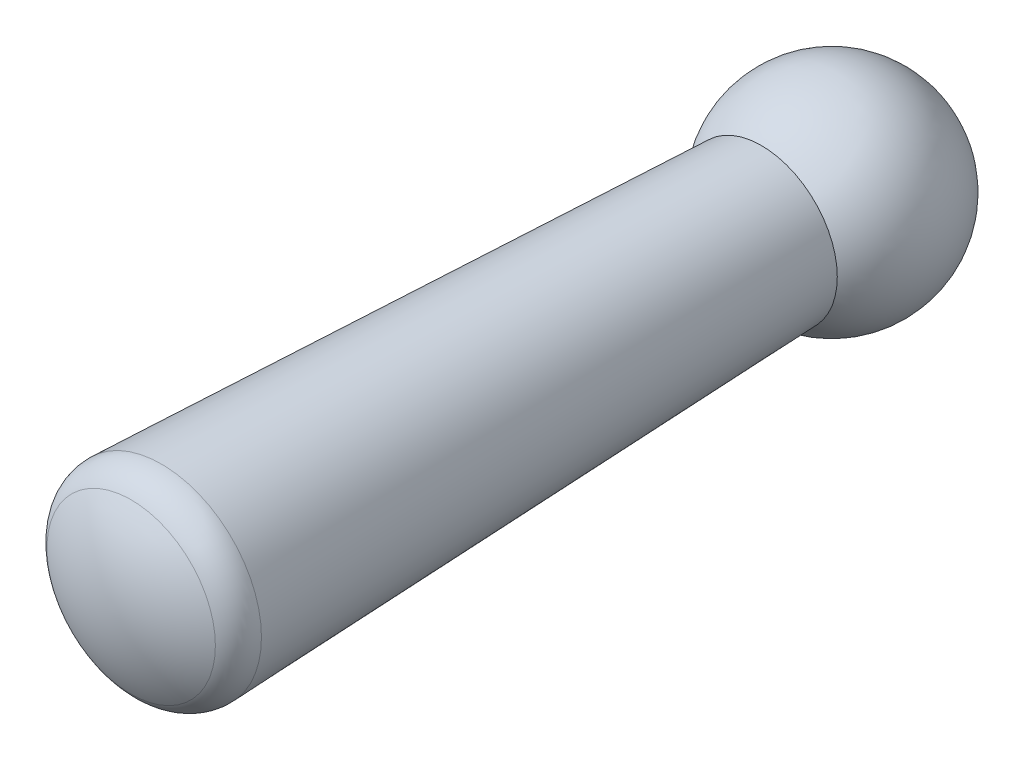
ISO-10303-21;
HEADER;
FILE_DESCRIPTION(('STEP AP214'),'2;1');
FILE_NAME('part.step','',(''),(''),'','','');
FILE_SCHEMA(('AUTOMOTIVE_DESIGN { 1 0 10303 214 1 1 1 1 }'));
ENDSEC;
DATA;
#1=APPLICATION_CONTEXT('core data for automotive mechanical design processes');
#2=APPLICATION_PROTOCOL_DEFINITION('international standard','automotive_design',2000,#1);
#3=PRODUCT_CONTEXT('',#1,'mechanical');
#4=PRODUCT('Part','Part','',(#3));
#5=PRODUCT_RELATED_PRODUCT_CATEGORY('part','',(#4));
#6=PRODUCT_DEFINITION_FORMATION('','',#4);
#7=PRODUCT_DEFINITION_CONTEXT('part definition',#1,'design');
#8=PRODUCT_DEFINITION('design','',#6,#7);
#9=PRODUCT_DEFINITION_SHAPE('','',#8);
#10=(LENGTH_UNIT() NAMED_UNIT(*) SI_UNIT(.MILLI.,.METRE.));
#11=(NAMED_UNIT(*) PLANE_ANGLE_UNIT() SI_UNIT($,.RADIAN.));
#12=(NAMED_UNIT(*) SI_UNIT($,.STERADIAN.) SOLID_ANGLE_UNIT());
#13=UNCERTAINTY_MEASURE_WITH_UNIT(LENGTH_MEASURE(1.E-05),#10,'distance_accuracy_value','');
#14=(GEOMETRIC_REPRESENTATION_CONTEXT(3) GLOBAL_UNCERTAINTY_ASSIGNED_CONTEXT((#13)) GLOBAL_UNIT_ASSIGNED_CONTEXT((#10,
#11,#12)) REPRESENTATION_CONTEXT('',''));
#15=CARTESIAN_POINT('',(0.,0.,0.));
#16=DIRECTION('',(0.,0.,1.));
#17=DIRECTION('',(1.,0.,0.));
#18=AXIS2_PLACEMENT_3D('',#15,#16,#17);
#19=CARTESIAN_POINT('',(0.,0.,16.539607805437));
#20=DIRECTION('',(0.,0.,1.));
#21=DIRECTION('',(1.,0.,0.));
#22=AXIS2_PLACEMENT_3D('',#19,#20,#21);
#23=SPHERICAL_SURFACE('',#22,4.5);
#24=CARTESIAN_POINT('',(0.,0.,16.539607805437));
#25=DIRECTION('',(0.,-1.,0.));
#26=DIRECTION('',(1.,0.,0.));
#27=AXIS2_PLACEMENT_3D('',#24,#25,#26);
#28=CIRCLE('',#27,4.5);
#29=CARTESIAN_POINT('',(2.442857142857,0.,20.318820551445));
#30=VERTEX_POINT('',#29);
#31=CARTESIAN_POINT('',(0.,0.,21.039607805437));
#32=VERTEX_POINT('',#31);
#33=EDGE_CURVE('E11',#30,#32,#28,.T.);
#34=ORIENTED_EDGE('',*,*,#33,.T.);
#35=ORIENTED_EDGE('',*,*,#33,.F.);
#36=CARTESIAN_POINT('',(0.,0.,20.318820551445));
#37=DIRECTION('',(0.,0.,-1.));
#38=DIRECTION('',(1.,0.,0.));
#39=AXIS2_PLACEMENT_3D('',#36,#37,#38);
#40=CIRCLE('',#39,2.442857142857);
#41=EDGE_CURVE('E26',#30,#30,#40,.T.);
#42=ORIENTED_EDGE('',*,*,#41,.F.);
#43=EDGE_LOOP('',(#34,#35,#42));
#44=FACE_BOUND('',#43,.T.);
#45=ADVANCED_FACE('F17',(#44),#23,.T.);
#46=CARTESIAN_POINT('',(0.,0.,19.478995496777));
#47=DIRECTION('',(0.,0.,1.));
#48=DIRECTION('',(1.,0.,0.));
#49=AXIS2_PLACEMENT_3D('',#46,#47,#48);
#50=TOROIDAL_SURFACE('',#49,1.9,1.);
#51=CARTESIAN_POINT('',(1.9,0.,19.478995496777));
#52=DIRECTION('',(0.,-1.,0.));
#53=DIRECTION('',(1.,0.,0.));
#54=AXIS2_PLACEMENT_3D('',#51,#52,#53);
#55=CIRCLE('',#54,1.);
#56=CARTESIAN_POINT('',(2.899193547253,0.,19.438842599885));
#57=VERTEX_POINT('',#56);
#58=EDGE_CURVE('E50',#57,#30,#55,.T.);
#59=ORIENTED_EDGE('',*,*,#58,.T.);
#60=ORIENTED_EDGE('',*,*,#41,.T.);
#61=ORIENTED_EDGE('',*,*,#58,.F.);
#62=CARTESIAN_POINT('',(0.,0.,19.438842599885));
#63=DIRECTION('',(0.,0.,-1.));
#64=DIRECTION('',(1.,0.,0.));
#65=AXIS2_PLACEMENT_3D('',#62,#63,#64);
#66=CIRCLE('',#65,2.899193547253);
#67=EDGE_CURVE('E53',#57,#57,#66,.T.);
#68=ORIENTED_EDGE('',*,*,#67,.F.);
#69=EDGE_LOOP('',(#59,#60,#61,#68));
#70=FACE_BOUND('',#69,.T.);
#71=ADVANCED_FACE('F52',(#70),#50,.T.);
#72=CARTESIAN_POINT('',(0.,0.,2.039607805437));
#73=DIRECTION('',(0.,0.,1.));
#74=DIRECTION('',(1.,0.,0.));
#75=AXIS2_PLACEMENT_3D('',#72,#73,#74);
#76=CONICAL_SURFACE('',#75,2.2,0.0401636941794195);
#77=DIRECTION('',(0.0401528968916534,0.,0.999193547252587));
#78=VECTOR('',#77,1.);
#79=CARTESIAN_POINT('',(2.2,0.,2.039607805437));
#80=LINE('',#79,#78);
#81=CARTESIAN_POINT('',(2.2,0.,2.039607805437));
#82=VERTEX_POINT('',#81);
#83=EDGE_CURVE('E60',#82,#57,#80,.T.);
#84=ORIENTED_EDGE('',*,*,#83,.T.);
#85=ORIENTED_EDGE('',*,*,#67,.T.);
#86=ORIENTED_EDGE('',*,*,#83,.F.);
#87=CARTESIAN_POINT('',(0.,0.,2.039607805437));
#88=DIRECTION('',(0.,0.,-1.));
#89=DIRECTION('',(1.,0.,0.));
#90=AXIS2_PLACEMENT_3D('',#87,#88,#89);
#91=CIRCLE('',#90,2.2);
#92=EDGE_CURVE('E66',#82,#82,#91,.T.);
#93=ORIENTED_EDGE('',*,*,#92,.F.);
#94=EDGE_LOOP('',(#84,#85,#86,#93));
#95=FACE_BOUND('',#94,.T.);
#96=ADVANCED_FACE('F58',(#95),#76,.T.);
#97=CARTESIAN_POINT('',(0.,0.,0.));
#98=DIRECTION('',(0.,0.,1.));
#99=DIRECTION('',(1.,0.,0.));
#100=AXIS2_PLACEMENT_3D('',#97,#98,#99);
#101=SPHERICAL_SURFACE('',#100,3.);
#102=CARTESIAN_POINT('',(0.,0.,0.));
#103=DIRECTION('',(0.,-1.,0.));
#104=DIRECTION('',(1.,0.,0.));
#105=AXIS2_PLACEMENT_3D('',#102,#103,#104);
#106=CIRCLE('',#105,3.);
#107=CARTESIAN_POINT('',(0.,0.,-3.));
#108=VERTEX_POINT('',#107);
#109=EDGE_CURVE('E107',#108,#82,#106,.T.);
#110=ORIENTED_EDGE('',*,*,#109,.T.);
#111=ORIENTED_EDGE('',*,*,#92,.T.);
#112=ORIENTED_EDGE('',*,*,#109,.F.);
#113=EDGE_LOOP('',(#110,#111,#112));
#114=FACE_BOUND('',#113,.T.);
#115=ADVANCED_FACE('F86',(#114),#101,.T.);
#116=CLOSED_SHELL('',(#45,#71,#96,#115));
#117=MANIFOLD_SOLID_BREP('B1',#116);
#118=ADVANCED_BREP_SHAPE_REPRESENTATION('',(#18,#117),#14);
#119=SHAPE_DEFINITION_REPRESENTATION(#9,#118);
ENDSEC;
END-ISO-10303-21;
